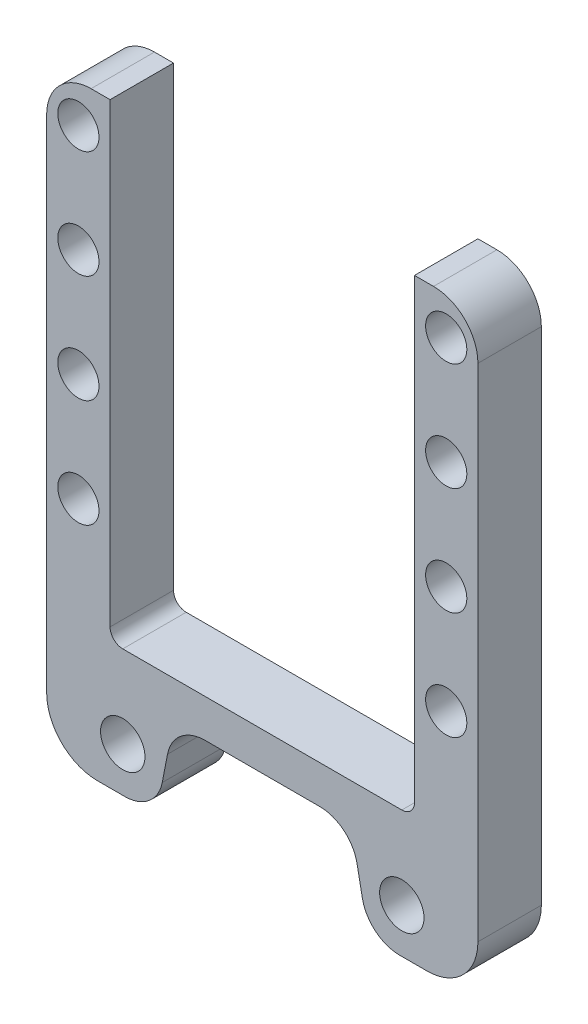
ISO-10303-21;
HEADER;
FILE_DESCRIPTION(('STEP AP214'),'2;1');
FILE_NAME('part.step','',(''),(''),'','','');
FILE_SCHEMA(('AUTOMOTIVE_DESIGN { 1 0 10303 214 1 1 1 1 }'));
ENDSEC;
DATA;
#1=APPLICATION_CONTEXT('core data for automotive mechanical design processes');
#2=APPLICATION_PROTOCOL_DEFINITION('international standard','automotive_design',2000,#1);
#3=PRODUCT_CONTEXT('',#1,'mechanical');
#4=PRODUCT('Part','Part','',(#3));
#5=PRODUCT_RELATED_PRODUCT_CATEGORY('part','',(#4));
#6=PRODUCT_DEFINITION_FORMATION('','',#4);
#7=PRODUCT_DEFINITION_CONTEXT('part definition',#1,'design');
#8=PRODUCT_DEFINITION('design','',#6,#7);
#9=PRODUCT_DEFINITION_SHAPE('','',#8);
#10=(LENGTH_UNIT() NAMED_UNIT(*) SI_UNIT(.MILLI.,.METRE.));
#11=(NAMED_UNIT(*) PLANE_ANGLE_UNIT() SI_UNIT($,.RADIAN.));
#12=(NAMED_UNIT(*) SI_UNIT($,.STERADIAN.) SOLID_ANGLE_UNIT());
#13=UNCERTAINTY_MEASURE_WITH_UNIT(LENGTH_MEASURE(1.E-05),#10,'distance_accuracy_value','');
#14=(GEOMETRIC_REPRESENTATION_CONTEXT(3) GLOBAL_UNCERTAINTY_ASSIGNED_CONTEXT((#13)) GLOBAL_UNIT_ASSIGNED_CONTEXT((#10,
#11,#12)) REPRESENTATION_CONTEXT('',''));
#15=CARTESIAN_POINT('',(0.,0.,0.));
#16=DIRECTION('',(0.,0.,1.));
#17=DIRECTION('',(1.,0.,0.));
#18=AXIS2_PLACEMENT_3D('',#15,#16,#17);
#19=CARTESIAN_POINT('',(0.,0.,10.));
#20=DIRECTION('',(0.,0.,1.));
#21=DIRECTION('',(1.,0.,0.));
#22=AXIS2_PLACEMENT_3D('',#19,#20,#21);
#23=PLANE('',#22);
#24=CARTESIAN_POINT('',(29.,53.,10.));
#25=DIRECTION('',(0.,0.,1.));
#26=DIRECTION('',(1.,0.,0.));
#27=AXIS2_PLACEMENT_3D('',#24,#25,#26);
#28=CIRCLE('',#27,3.25);
#29=CARTESIAN_POINT('',(32.25,53.,10.));
#30=VERTEX_POINT('',#29);
#31=EDGE_CURVE('E242',#30,#30,#28,.T.);
#32=ORIENTED_EDGE('',*,*,#31,.F.);
#33=EDGE_LOOP('',(#32));
#34=FACE_BOUND('',#33,.T.);
#35=CARTESIAN_POINT('',(29.,87.,10.));
#36=DIRECTION('',(0.,0.,1.));
#37=DIRECTION('',(1.,0.,0.));
#38=AXIS2_PLACEMENT_3D('',#35,#36,#37);
#39=CIRCLE('',#38,3.25);
#40=CARTESIAN_POINT('',(32.25,87.,10.));
#41=VERTEX_POINT('',#40);
#42=EDGE_CURVE('E254',#41,#41,#39,.T.);
#43=ORIENTED_EDGE('',*,*,#42,.F.);
#44=EDGE_LOOP('',(#43));
#45=FACE_BOUND('',#44,.T.);
#46=DIRECTION('',(0.,1.,0.));
#47=VECTOR('',#46,1.);
#48=CARTESIAN_POINT('',(34.,16.,10.));
#49=LINE('',#48,#47);
#50=CARTESIAN_POINT('',(34.,24.,10.));
#51=VERTEX_POINT('',#50);
#52=CARTESIAN_POINT('',(34.,103.,10.));
#53=VERTEX_POINT('',#52);
#54=EDGE_CURVE('E282',#51,#53,#49,.T.);
#55=ORIENTED_EDGE('',*,*,#54,.T.);
#56=CARTESIAN_POINT('',(27.,103.,10.));
#57=DIRECTION('',(0.,0.,1.));
#58=DIRECTION('',(1.,0.,0.));
#59=AXIS2_PLACEMENT_3D('',#56,#57,#58);
#60=CIRCLE('',#59,7.);
#61=CARTESIAN_POINT('',(27.,110.,10.));
#62=VERTEX_POINT('',#61);
#63=EDGE_CURVE('E369',#53,#62,#60,.T.);
#64=ORIENTED_EDGE('',*,*,#63,.T.);
#65=DIRECTION('',(-1.,0.,0.));
#66=VECTOR('',#65,1.);
#67=CARTESIAN_POINT('',(34.,110.,10.));
#68=LINE('',#67,#66);
#69=CARTESIAN_POINT('',(24.,110.,10.));
#70=VERTEX_POINT('',#69);
#71=EDGE_CURVE('E266',#62,#70,#68,.T.);
#72=ORIENTED_EDGE('',*,*,#71,.T.);
#73=DIRECTION('',(0.,-1.,0.));
#74=VECTOR('',#73,1.);
#75=CARTESIAN_POINT('',(24.,110.,10.));
#76=LINE('',#75,#74);
#77=CARTESIAN_POINT('',(24.,38.,10.));
#78=VERTEX_POINT('',#77);
#79=EDGE_CURVE('E268',#70,#78,#76,.T.);
#80=ORIENTED_EDGE('',*,*,#79,.T.);
#81=CARTESIAN_POINT('',(22.,38.,10.));
#82=DIRECTION('',(0.,0.,1.));
#83=DIRECTION('',(1.,0.,0.));
#84=AXIS2_PLACEMENT_3D('',#81,#82,#83);
#85=CIRCLE('',#84,2.);
#86=CARTESIAN_POINT('',(22.,36.,10.));
#87=VERTEX_POINT('',#86);
#88=EDGE_CURVE('E11',#78,#87,#85,.F.);
#89=ORIENTED_EDGE('',*,*,#88,.T.);
#90=DIRECTION('',(-1.,0.,0.));
#91=VECTOR('',#90,1.);
#92=CARTESIAN_POINT('',(24.,36.,10.));
#93=LINE('',#92,#91);
#94=CARTESIAN_POINT('',(-22.,36.,10.));
#95=VERTEX_POINT('',#94);
#96=EDGE_CURVE('E271',#87,#95,#93,.T.);
#97=ORIENTED_EDGE('',*,*,#96,.T.);
#98=CARTESIAN_POINT('',(-22.,38.,10.));
#99=DIRECTION('',(0.,0.,1.));
#100=DIRECTION('',(1.,0.,0.));
#101=AXIS2_PLACEMENT_3D('',#98,#99,#100);
#102=CIRCLE('',#101,2.);
#103=CARTESIAN_POINT('',(-24.,38.,10.));
#104=VERTEX_POINT('',#103);
#105=EDGE_CURVE('E212',#95,#104,#102,.F.);
#106=ORIENTED_EDGE('',*,*,#105,.T.);
#107=DIRECTION('',(0.,-1.,0.));
#108=VECTOR('',#107,1.);
#109=CARTESIAN_POINT('',(-24.,110.,10.));
#110=LINE('',#109,#108);
#111=CARTESIAN_POINT('',(-24.,110.,10.));
#112=VERTEX_POINT('',#111);
#113=EDGE_CURVE('E195',#112,#104,#110,.T.);
#114=ORIENTED_EDGE('',*,*,#113,.F.);
#115=DIRECTION('',(1.,0.,0.));
#116=VECTOR('',#115,1.);
#117=CARTESIAN_POINT('',(-34.,110.,10.));
#118=LINE('',#117,#116);
#119=CARTESIAN_POINT('',(-27.,110.,10.));
#120=VERTEX_POINT('',#119);
#121=EDGE_CURVE('E184',#120,#112,#118,.T.);
#122=ORIENTED_EDGE('',*,*,#121,.F.);
#123=CARTESIAN_POINT('',(-27.,103.,10.));
#124=DIRECTION('',(0.,0.,1.));
#125=DIRECTION('',(1.,0.,0.));
#126=AXIS2_PLACEMENT_3D('',#123,#124,#125);
#127=CIRCLE('',#126,7.);
#128=CARTESIAN_POINT('',(-34.,103.,10.));
#129=VERTEX_POINT('',#128);
#130=EDGE_CURVE('E367',#120,#129,#127,.T.);
#131=ORIENTED_EDGE('',*,*,#130,.T.);
#132=DIRECTION('',(0.,1.,0.));
#133=VECTOR('',#132,1.);
#134=CARTESIAN_POINT('',(-34.,16.,10.));
#135=LINE('',#134,#133);
#136=CARTESIAN_POINT('',(-34.,24.,10.));
#137=VERTEX_POINT('',#136);
#138=EDGE_CURVE('E206',#137,#129,#135,.T.);
#139=ORIENTED_EDGE('',*,*,#138,.F.);
#140=CARTESIAN_POINT('',(-26.,24.,10.));
#141=DIRECTION('',(0.,0.,1.));
#142=DIRECTION('',(1.,0.,0.));
#143=AXIS2_PLACEMENT_3D('',#140,#141,#142);
#144=CIRCLE('',#143,8.);
#145=CARTESIAN_POINT('',(-26.,16.,10.));
#146=VERTEX_POINT('',#145);
#147=EDGE_CURVE('E351',#137,#146,#144,.T.);
#148=ORIENTED_EDGE('',*,*,#147,.T.);
#149=DIRECTION('',(-1.,0.,0.));
#150=VECTOR('',#149,1.);
#151=CARTESIAN_POINT('',(-16.721324327928,16.,10.));
#152=LINE('',#151,#150);
#153=CARTESIAN_POINT('',(-21.667342642833,16.,10.));
#154=VERTEX_POINT('',#153);
#155=EDGE_CURVE('E216',#154,#146,#152,.T.);
#156=ORIENTED_EDGE('',*,*,#155,.F.);
#157=CARTESIAN_POINT('',(-21.667342642833,22.,10.));
#158=DIRECTION('',(0.,0.,1.));
#159=DIRECTION('',(1.,0.,0.));
#160=AXIS2_PLACEMENT_3D('',#157,#158,#159);
#161=CIRCLE('',#160,6.);
#162=CARTESIAN_POINT('',(-15.777579542147,20.8551460277407,10.));
#163=VERTEX_POINT('',#162);
#164=EDGE_CURVE('E316',#154,#163,#161,.T.);
#165=ORIENTED_EDGE('',*,*,#164,.T.);
#166=DIRECTION('',(-0.190808995376542,-0.981627183447665,0.));
#167=VECTOR('',#166,1.);
#168=CARTESIAN_POINT('',(-14.,30.,10.));
#169=LINE('',#168,#167);
#170=CARTESIAN_POINT('',(-14.943744785781,25.1448539722593,10.));
#171=VERTEX_POINT('',#170);
#172=EDGE_CURVE('E213',#171,#163,#169,.T.);
#173=ORIENTED_EDGE('',*,*,#172,.F.);
#174=CARTESIAN_POINT('',(-9.05398168509501,24.,10.));
#175=DIRECTION('',(0.,0.,1.));
#176=DIRECTION('',(1.,0.,0.));
#177=AXIS2_PLACEMENT_3D('',#174,#175,#176);
#178=CIRCLE('',#177,6.);
#179=CARTESIAN_POINT('',(-9.05398168509501,30.,10.));
#180=VERTEX_POINT('',#179);
#181=EDGE_CURVE('E334',#171,#180,#178,.F.);
#182=ORIENTED_EDGE('',*,*,#181,.T.);
#183=DIRECTION('',(1.,0.,0.));
#184=VECTOR('',#183,1.);
#185=CARTESIAN_POINT('',(0.,30.,10.));
#186=LINE('',#185,#184);
#187=CARTESIAN_POINT('',(9.05398168509501,30.,10.));
#188=VERTEX_POINT('',#187);
#189=EDGE_CURVE('E273',#180,#188,#186,.T.);
#190=ORIENTED_EDGE('',*,*,#189,.T.);
#191=CARTESIAN_POINT('',(9.05398168509501,24.,10.));
#192=DIRECTION('',(0.,0.,1.));
#193=DIRECTION('',(1.,0.,0.));
#194=AXIS2_PLACEMENT_3D('',#191,#192,#193);
#195=CIRCLE('',#194,6.);
#196=CARTESIAN_POINT('',(14.943744785781,25.1448539722593,10.));
#197=VERTEX_POINT('',#196);
#198=EDGE_CURVE('E338',#188,#197,#195,.F.);
#199=ORIENTED_EDGE('',*,*,#198,.T.);
#200=DIRECTION('',(0.190808995376542,-0.981627183447665,0.));
#201=VECTOR('',#200,1.);
#202=CARTESIAN_POINT('',(14.,30.,10.));
#203=LINE('',#202,#201);
#204=CARTESIAN_POINT('',(15.777579542147,20.8551460277407,10.));
#205=VERTEX_POINT('',#204);
#206=EDGE_CURVE('E276',#197,#205,#203,.T.);
#207=ORIENTED_EDGE('',*,*,#206,.T.);
#208=CARTESIAN_POINT('',(21.667342642833,22.,10.));
#209=DIRECTION('',(0.,0.,1.));
#210=DIRECTION('',(1.,0.,0.));
#211=AXIS2_PLACEMENT_3D('',#208,#209,#210);
#212=CIRCLE('',#211,6.);
#213=CARTESIAN_POINT('',(21.667342642833,16.,10.));
#214=VERTEX_POINT('',#213);
#215=EDGE_CURVE('E318',#205,#214,#212,.T.);
#216=ORIENTED_EDGE('',*,*,#215,.T.);
#217=DIRECTION('',(1.,0.,0.));
#218=VECTOR('',#217,1.);
#219=CARTESIAN_POINT('',(16.721324327928,16.,10.));
#220=LINE('',#219,#218);
#221=CARTESIAN_POINT('',(26.,16.,10.));
#222=VERTEX_POINT('',#221);
#223=EDGE_CURVE('E279',#214,#222,#220,.T.);
#224=ORIENTED_EDGE('',*,*,#223,.T.);
#225=CARTESIAN_POINT('',(26.,24.,10.));
#226=DIRECTION('',(0.,0.,1.));
#227=DIRECTION('',(1.,0.,0.));
#228=AXIS2_PLACEMENT_3D('',#225,#226,#227);
#229=CIRCLE('',#228,8.);
#230=EDGE_CURVE('E349',#222,#51,#229,.T.);
#231=ORIENTED_EDGE('',*,*,#230,.T.);
#232=EDGE_LOOP('',(#55,#64,#72,#80,#89,#97,#106,#114,#122,#131,#139,#148,#156,#165,#173,#182,
#190,#199,#207,#216,#224,#231));
#233=FACE_BOUND('',#232,.T.);
#234=CARTESIAN_POINT('',(22.,23.,10.));
#235=DIRECTION('',(0.,0.,1.));
#236=DIRECTION('',(1.,0.,0.));
#237=AXIS2_PLACEMENT_3D('',#234,#235,#236);
#238=CIRCLE('',#237,3.5);
#239=CARTESIAN_POINT('',(25.5,23.,10.));
#240=VERTEX_POINT('',#239);
#241=EDGE_CURVE('E260',#240,#240,#238,.T.);
#242=ORIENTED_EDGE('',*,*,#241,.F.);
#243=EDGE_LOOP('',(#242));
#244=FACE_BOUND('',#243,.T.);
#245=CARTESIAN_POINT('',(29.,104.,10.));
#246=DIRECTION('',(0.,0.,1.));
#247=DIRECTION('',(1.,0.,0.));
#248=AXIS2_PLACEMENT_3D('',#245,#246,#247);
#249=CIRCLE('',#248,3.25);
#250=CARTESIAN_POINT('',(32.25,104.,10.));
#251=VERTEX_POINT('',#250);
#252=EDGE_CURVE('E248',#251,#251,#249,.T.);
#253=ORIENTED_EDGE('',*,*,#252,.F.);
#254=EDGE_LOOP('',(#253));
#255=FACE_BOUND('',#254,.T.);
#256=CARTESIAN_POINT('',(29.,70.,10.));
#257=DIRECTION('',(0.,0.,1.));
#258=DIRECTION('',(1.,0.,0.));
#259=AXIS2_PLACEMENT_3D('',#256,#257,#258);
#260=CIRCLE('',#259,3.25);
#261=CARTESIAN_POINT('',(32.25,70.,10.));
#262=VERTEX_POINT('',#261);
#263=EDGE_CURVE('E236',#262,#262,#260,.T.);
#264=ORIENTED_EDGE('',*,*,#263,.F.);
#265=EDGE_LOOP('',(#264));
#266=FACE_BOUND('',#265,.T.);
#267=CARTESIAN_POINT('',(-29.,53.,10.));
#268=DIRECTION('',(0.,0.,-1.));
#269=DIRECTION('',(-1.,0.,0.));
#270=AXIS2_PLACEMENT_3D('',#267,#268,#269);
#271=CIRCLE('',#270,3.25);
#272=CARTESIAN_POINT('',(-32.25,53.,10.));
#273=VERTEX_POINT('',#272);
#274=EDGE_CURVE('E590',#273,#273,#271,.T.);
#275=ORIENTED_EDGE('',*,*,#274,.T.);
#276=EDGE_LOOP('',(#275));
#277=FACE_BOUND('',#276,.T.);
#278=CARTESIAN_POINT('',(-29.,87.,10.));
#279=DIRECTION('',(0.,0.,-1.));
#280=DIRECTION('',(-1.,0.,0.));
#281=AXIS2_PLACEMENT_3D('',#278,#279,#280);
#282=CIRCLE('',#281,3.25);
#283=CARTESIAN_POINT('',(-32.25,87.,10.));
#284=VERTEX_POINT('',#283);
#285=EDGE_CURVE('E598',#284,#284,#282,.T.);
#286=ORIENTED_EDGE('',*,*,#285,.T.);
#287=EDGE_LOOP('',(#286));
#288=FACE_BOUND('',#287,.T.);
#289=CARTESIAN_POINT('',(-22.,23.,10.));
#290=DIRECTION('',(0.,0.,-1.));
#291=DIRECTION('',(-1.,0.,0.));
#292=AXIS2_PLACEMENT_3D('',#289,#290,#291);
#293=CIRCLE('',#292,3.5);
#294=CARTESIAN_POINT('',(-25.5,23.,10.));
#295=VERTEX_POINT('',#294);
#296=EDGE_CURVE('E226',#295,#295,#293,.T.);
#297=ORIENTED_EDGE('',*,*,#296,.T.);
#298=EDGE_LOOP('',(#297));
#299=FACE_BOUND('',#298,.T.);
#300=CARTESIAN_POINT('',(-29.,104.,10.));
#301=DIRECTION('',(0.,0.,-1.));
#302=DIRECTION('',(-1.,0.,0.));
#303=AXIS2_PLACEMENT_3D('',#300,#301,#302);
#304=CIRCLE('',#303,3.25);
#305=CARTESIAN_POINT('',(-32.25,104.,10.));
#306=VERTEX_POINT('',#305);
#307=EDGE_CURVE('E594',#306,#306,#304,.T.);
#308=ORIENTED_EDGE('',*,*,#307,.T.);
#309=EDGE_LOOP('',(#308));
#310=FACE_BOUND('',#309,.T.);
#311=CARTESIAN_POINT('',(-29.,70.,10.));
#312=DIRECTION('',(0.,0.,-1.));
#313=DIRECTION('',(-1.,0.,0.));
#314=AXIS2_PLACEMENT_3D('',#311,#312,#313);
#315=CIRCLE('',#314,3.25);
#316=CARTESIAN_POINT('',(-32.25,70.,10.));
#317=VERTEX_POINT('',#316);
#318=EDGE_CURVE('E585',#317,#317,#315,.T.);
#319=ORIENTED_EDGE('',*,*,#318,.T.);
#320=EDGE_LOOP('',(#319));
#321=FACE_BOUND('',#320,.T.);
#322=ADVANCED_FACE('F35',(#34,#45,#233,#244,#255,#266,#277,#288,#299,#310,#321),#23,.T.);
#323=CARTESIAN_POINT('',(0.,0.,0.));
#324=DIRECTION('',(0.,0.,1.));
#325=DIRECTION('',(1.,0.,0.));
#326=AXIS2_PLACEMENT_3D('',#323,#324,#325);
#327=PLANE('',#326);
#328=DIRECTION('',(-1.,0.,0.));
#329=VECTOR('',#328,1.);
#330=CARTESIAN_POINT('',(34.,110.,0.));
#331=LINE('',#330,#329);
#332=CARTESIAN_POINT('',(27.,110.,0.));
#333=VERTEX_POINT('',#332);
#334=CARTESIAN_POINT('',(24.,110.,0.));
#335=VERTEX_POINT('',#334);
#336=EDGE_CURVE('E263',#333,#335,#331,.T.);
#337=ORIENTED_EDGE('',*,*,#336,.F.);
#338=CARTESIAN_POINT('',(27.,103.,0.));
#339=DIRECTION('',(0.,0.,1.));
#340=DIRECTION('',(1.,0.,0.));
#341=AXIS2_PLACEMENT_3D('',#338,#339,#340);
#342=CIRCLE('',#341,7.);
#343=CARTESIAN_POINT('',(34.,103.,0.));
#344=VERTEX_POINT('',#343);
#345=EDGE_CURVE('E363',#333,#344,#342,.F.);
#346=ORIENTED_EDGE('',*,*,#345,.T.);
#347=DIRECTION('',(0.,1.,0.));
#348=VECTOR('',#347,1.);
#349=CARTESIAN_POINT('',(34.,16.,0.));
#350=LINE('',#349,#348);
#351=CARTESIAN_POINT('',(34.,24.,0.));
#352=VERTEX_POINT('',#351);
#353=EDGE_CURVE('E269',#352,#344,#350,.T.);
#354=ORIENTED_EDGE('',*,*,#353,.F.);
#355=CARTESIAN_POINT('',(26.,24.,0.));
#356=DIRECTION('',(0.,0.,1.));
#357=DIRECTION('',(1.,0.,0.));
#358=AXIS2_PLACEMENT_3D('',#355,#356,#357);
#359=CIRCLE('',#358,8.);
#360=CARTESIAN_POINT('',(26.,16.,0.));
#361=VERTEX_POINT('',#360);
#362=EDGE_CURVE('E343',#352,#361,#359,.F.);
#363=ORIENTED_EDGE('',*,*,#362,.T.);
#364=DIRECTION('',(1.,0.,0.));
#365=VECTOR('',#364,1.);
#366=CARTESIAN_POINT('',(16.721324327928,16.,0.));
#367=LINE('',#366,#365);
#368=CARTESIAN_POINT('',(21.667342642833,16.,0.));
#369=VERTEX_POINT('',#368);
#370=EDGE_CURVE('E297',#369,#361,#367,.T.);
#371=ORIENTED_EDGE('',*,*,#370,.F.);
#372=CARTESIAN_POINT('',(21.667342642833,22.,0.));
#373=DIRECTION('',(0.,0.,1.));
#374=DIRECTION('',(1.,0.,0.));
#375=AXIS2_PLACEMENT_3D('',#372,#373,#374);
#376=CIRCLE('',#375,6.);
#377=CARTESIAN_POINT('',(15.777579542147,20.8551460277407,0.));
#378=VERTEX_POINT('',#377);
#379=EDGE_CURVE('E309',#369,#378,#376,.F.);
#380=ORIENTED_EDGE('',*,*,#379,.T.);
#381=DIRECTION('',(0.190808995376542,-0.981627183447665,0.));
#382=VECTOR('',#381,1.);
#383=CARTESIAN_POINT('',(14.,30.,0.));
#384=LINE('',#383,#382);
#385=CARTESIAN_POINT('',(14.943744785781,25.1448539722593,0.));
#386=VERTEX_POINT('',#385);
#387=EDGE_CURVE('E294',#386,#378,#384,.T.);
#388=ORIENTED_EDGE('',*,*,#387,.F.);
#389=CARTESIAN_POINT('',(9.05398168509501,24.,0.));
#390=DIRECTION('',(0.,0.,1.));
#391=DIRECTION('',(1.,0.,0.));
#392=AXIS2_PLACEMENT_3D('',#389,#390,#391);
#393=CIRCLE('',#392,6.);
#394=CARTESIAN_POINT('',(9.05398168509501,30.,0.));
#395=VERTEX_POINT('',#394);
#396=EDGE_CURVE('E336',#386,#395,#393,.T.);
#397=ORIENTED_EDGE('',*,*,#396,.T.);
#398=DIRECTION('',(1.,0.,0.));
#399=VECTOR('',#398,1.);
#400=CARTESIAN_POINT('',(0.,30.,0.));
#401=LINE('',#400,#399);
#402=CARTESIAN_POINT('',(-9.05398168509501,30.,0.));
#403=VERTEX_POINT('',#402);
#404=EDGE_CURVE('E291',#403,#395,#401,.T.);
#405=ORIENTED_EDGE('',*,*,#404,.F.);
#406=CARTESIAN_POINT('',(-9.05398168509501,24.,0.));
#407=DIRECTION('',(0.,0.,1.));
#408=DIRECTION('',(1.,0.,0.));
#409=AXIS2_PLACEMENT_3D('',#406,#407,#408);
#410=CIRCLE('',#409,6.);
#411=CARTESIAN_POINT('',(-14.943744785781,25.1448539722593,0.));
#412=VERTEX_POINT('',#411);
#413=EDGE_CURVE('E332',#403,#412,#410,.T.);
#414=ORIENTED_EDGE('',*,*,#413,.T.);
#415=DIRECTION('',(-0.190808995376542,-0.981627183447665,0.));
#416=VECTOR('',#415,1.);
#417=CARTESIAN_POINT('',(-14.,30.,0.));
#418=LINE('',#417,#416);
#419=CARTESIAN_POINT('',(-15.777579542147,20.8551460277407,0.));
#420=VERTEX_POINT('',#419);
#421=EDGE_CURVE('E228',#412,#420,#418,.T.);
#422=ORIENTED_EDGE('',*,*,#421,.T.);
#423=CARTESIAN_POINT('',(-21.667342642833,22.,0.));
#424=DIRECTION('',(0.,0.,1.));
#425=DIRECTION('',(1.,0.,0.));
#426=AXIS2_PLACEMENT_3D('',#423,#424,#425);
#427=CIRCLE('',#426,6.);
#428=CARTESIAN_POINT('',(-21.667342642833,16.,0.));
#429=VERTEX_POINT('',#428);
#430=EDGE_CURVE('E307',#420,#429,#427,.F.);
#431=ORIENTED_EDGE('',*,*,#430,.T.);
#432=DIRECTION('',(-1.,0.,0.));
#433=VECTOR('',#432,1.);
#434=CARTESIAN_POINT('',(-16.721324327928,16.,0.));
#435=LINE('',#434,#433);
#436=CARTESIAN_POINT('',(-26.,16.,0.));
#437=VERTEX_POINT('',#436);
#438=EDGE_CURVE('E231',#429,#437,#435,.T.);
#439=ORIENTED_EDGE('',*,*,#438,.T.);
#440=CARTESIAN_POINT('',(-26.,24.,0.));
#441=DIRECTION('',(0.,0.,1.));
#442=DIRECTION('',(1.,0.,0.));
#443=AXIS2_PLACEMENT_3D('',#440,#441,#442);
#444=CIRCLE('',#443,8.);
#445=CARTESIAN_POINT('',(-34.,24.,0.));
#446=VERTEX_POINT('',#445);
#447=EDGE_CURVE('E345',#437,#446,#444,.F.);
#448=ORIENTED_EDGE('',*,*,#447,.T.);
#449=DIRECTION('',(0.,1.,0.));
#450=VECTOR('',#449,1.);
#451=CARTESIAN_POINT('',(-34.,16.,0.));
#452=LINE('',#451,#450);
#453=CARTESIAN_POINT('',(-34.,103.,0.));
#454=VERTEX_POINT('',#453);
#455=EDGE_CURVE('E196',#446,#454,#452,.T.);
#456=ORIENTED_EDGE('',*,*,#455,.T.);
#457=CARTESIAN_POINT('',(-27.,103.,0.));
#458=DIRECTION('',(0.,0.,1.));
#459=DIRECTION('',(1.,0.,0.));
#460=AXIS2_PLACEMENT_3D('',#457,#458,#459);
#461=CIRCLE('',#460,7.);
#462=CARTESIAN_POINT('',(-27.,110.,0.));
#463=VERTEX_POINT('',#462);
#464=EDGE_CURVE('E361',#454,#463,#461,.F.);
#465=ORIENTED_EDGE('',*,*,#464,.T.);
#466=DIRECTION('',(1.,0.,0.));
#467=VECTOR('',#466,1.);
#468=CARTESIAN_POINT('',(-34.,110.,0.));
#469=LINE('',#468,#467);
#470=CARTESIAN_POINT('',(-24.,110.,0.));
#471=VERTEX_POINT('',#470);
#472=EDGE_CURVE('E224',#463,#471,#469,.T.);
#473=ORIENTED_EDGE('',*,*,#472,.T.);
#474=DIRECTION('',(0.,-1.,0.));
#475=VECTOR('',#474,1.);
#476=CARTESIAN_POINT('',(-24.,110.,0.));
#477=LINE('',#476,#475);
#478=CARTESIAN_POINT('',(-24.,38.,0.));
#479=VERTEX_POINT('',#478);
#480=EDGE_CURVE('E204',#471,#479,#477,.T.);
#481=ORIENTED_EDGE('',*,*,#480,.T.);
#482=CARTESIAN_POINT('',(-22.,38.,0.));
#483=DIRECTION('',(0.,0.,1.));
#484=DIRECTION('',(1.,0.,0.));
#485=AXIS2_PLACEMENT_3D('',#482,#483,#484);
#486=CIRCLE('',#485,2.);
#487=CARTESIAN_POINT('',(-22.,36.,0.));
#488=VERTEX_POINT('',#487);
#489=EDGE_CURVE('E383',#479,#488,#486,.T.);
#490=ORIENTED_EDGE('',*,*,#489,.T.);
#491=DIRECTION('',(-1.,0.,0.));
#492=VECTOR('',#491,1.);
#493=CARTESIAN_POINT('',(24.,36.,0.));
#494=LINE('',#493,#492);
#495=CARTESIAN_POINT('',(22.,36.,0.));
#496=VERTEX_POINT('',#495);
#497=EDGE_CURVE('E288',#496,#488,#494,.T.);
#498=ORIENTED_EDGE('',*,*,#497,.F.);
#499=CARTESIAN_POINT('',(22.,38.,0.));
#500=DIRECTION('',(0.,0.,1.));
#501=DIRECTION('',(1.,0.,0.));
#502=AXIS2_PLACEMENT_3D('',#499,#500,#501);
#503=CIRCLE('',#502,2.);
#504=CARTESIAN_POINT('',(24.,38.,0.));
#505=VERTEX_POINT('',#504);
#506=EDGE_CURVE('E43',#496,#505,#503,.T.);
#507=ORIENTED_EDGE('',*,*,#506,.T.);
#508=DIRECTION('',(0.,-1.,0.));
#509=VECTOR('',#508,1.);
#510=CARTESIAN_POINT('',(24.,110.,0.));
#511=LINE('',#510,#509);
#512=EDGE_CURVE('E286',#335,#505,#511,.T.);
#513=ORIENTED_EDGE('',*,*,#512,.F.);
#514=EDGE_LOOP('',(#337,#346,#354,#363,#371,#380,#388,#397,#405,#414,#422,#431,#439,#448,#456,
#465,#473,#481,#490,#498,#507,#513));
#515=FACE_BOUND('',#514,.T.);
#516=CARTESIAN_POINT('',(22.,23.,0.));
#517=DIRECTION('',(0.,0.,1.));
#518=DIRECTION('',(1.,0.,0.));
#519=AXIS2_PLACEMENT_3D('',#516,#517,#518);
#520=CIRCLE('',#519,3.5);
#521=CARTESIAN_POINT('',(25.5,23.,0.));
#522=VERTEX_POINT('',#521);
#523=EDGE_CURVE('E257',#522,#522,#520,.T.);
#524=ORIENTED_EDGE('',*,*,#523,.T.);
#525=EDGE_LOOP('',(#524));
#526=FACE_BOUND('',#525,.T.);
#527=CARTESIAN_POINT('',(29.,87.,0.));
#528=DIRECTION('',(0.,0.,1.));
#529=DIRECTION('',(1.,0.,0.));
#530=AXIS2_PLACEMENT_3D('',#527,#528,#529);
#531=CIRCLE('',#530,3.25);
#532=CARTESIAN_POINT('',(32.25,87.,0.));
#533=VERTEX_POINT('',#532);
#534=EDGE_CURVE('E251',#533,#533,#531,.T.);
#535=ORIENTED_EDGE('',*,*,#534,.T.);
#536=EDGE_LOOP('',(#535));
#537=FACE_BOUND('',#536,.T.);
#538=CARTESIAN_POINT('',(29.,104.,0.));
#539=DIRECTION('',(0.,0.,1.));
#540=DIRECTION('',(1.,0.,0.));
#541=AXIS2_PLACEMENT_3D('',#538,#539,#540);
#542=CIRCLE('',#541,3.25);
#543=CARTESIAN_POINT('',(32.25,104.,0.));
#544=VERTEX_POINT('',#543);
#545=EDGE_CURVE('E245',#544,#544,#542,.T.);
#546=ORIENTED_EDGE('',*,*,#545,.T.);
#547=EDGE_LOOP('',(#546));
#548=FACE_BOUND('',#547,.T.);
#549=CARTESIAN_POINT('',(29.,53.,0.));
#550=DIRECTION('',(0.,0.,1.));
#551=DIRECTION('',(1.,0.,0.));
#552=AXIS2_PLACEMENT_3D('',#549,#550,#551);
#553=CIRCLE('',#552,3.25);
#554=CARTESIAN_POINT('',(32.25,53.,0.));
#555=VERTEX_POINT('',#554);
#556=EDGE_CURVE('E239',#555,#555,#553,.T.);
#557=ORIENTED_EDGE('',*,*,#556,.T.);
#558=EDGE_LOOP('',(#557));
#559=FACE_BOUND('',#558,.T.);
#560=CARTESIAN_POINT('',(29.,70.,0.));
#561=DIRECTION('',(0.,0.,1.));
#562=DIRECTION('',(1.,0.,0.));
#563=AXIS2_PLACEMENT_3D('',#560,#561,#562);
#564=CIRCLE('',#563,3.25);
#565=CARTESIAN_POINT('',(32.25,70.,0.));
#566=VERTEX_POINT('',#565);
#567=EDGE_CURVE('E205',#566,#566,#564,.T.);
#568=ORIENTED_EDGE('',*,*,#567,.T.);
#569=EDGE_LOOP('',(#568));
#570=FACE_BOUND('',#569,.T.);
#571=CARTESIAN_POINT('',(-22.,23.,0.));
#572=DIRECTION('',(0.,0.,-1.));
#573=DIRECTION('',(-1.,0.,0.));
#574=AXIS2_PLACEMENT_3D('',#571,#572,#573);
#575=CIRCLE('',#574,3.5);
#576=CARTESIAN_POINT('',(-25.5,23.,0.));
#577=VERTEX_POINT('',#576);
#578=EDGE_CURVE('E568',#577,#577,#575,.T.);
#579=ORIENTED_EDGE('',*,*,#578,.F.);
#580=EDGE_LOOP('',(#579));
#581=FACE_BOUND('',#580,.T.);
#582=CARTESIAN_POINT('',(-29.,87.,0.));
#583=DIRECTION('',(0.,0.,-1.));
#584=DIRECTION('',(-1.,0.,0.));
#585=AXIS2_PLACEMENT_3D('',#582,#583,#584);
#586=CIRCLE('',#585,3.25);
#587=CARTESIAN_POINT('',(-32.25,87.,0.));
#588=VERTEX_POINT('',#587);
#589=EDGE_CURVE('E572',#588,#588,#586,.T.);
#590=ORIENTED_EDGE('',*,*,#589,.F.);
#591=EDGE_LOOP('',(#590));
#592=FACE_BOUND('',#591,.T.);
#593=CARTESIAN_POINT('',(-29.,104.,0.));
#594=DIRECTION('',(0.,0.,-1.));
#595=DIRECTION('',(-1.,0.,0.));
#596=AXIS2_PLACEMENT_3D('',#593,#594,#595);
#597=CIRCLE('',#596,3.25);
#598=CARTESIAN_POINT('',(-32.25,104.,0.));
#599=VERTEX_POINT('',#598);
#600=EDGE_CURVE('E576',#599,#599,#597,.T.);
#601=ORIENTED_EDGE('',*,*,#600,.F.);
#602=EDGE_LOOP('',(#601));
#603=FACE_BOUND('',#602,.T.);
#604=CARTESIAN_POINT('',(-29.,53.,0.));
#605=DIRECTION('',(0.,0.,-1.));
#606=DIRECTION('',(-1.,0.,0.));
#607=AXIS2_PLACEMENT_3D('',#604,#605,#606);
#608=CIRCLE('',#607,3.25);
#609=CARTESIAN_POINT('',(-32.25,53.,0.));
#610=VERTEX_POINT('',#609);
#611=EDGE_CURVE('E580',#610,#610,#608,.T.);
#612=ORIENTED_EDGE('',*,*,#611,.F.);
#613=EDGE_LOOP('',(#612));
#614=FACE_BOUND('',#613,.T.);
#615=CARTESIAN_POINT('',(-29.,70.,0.));
#616=DIRECTION('',(0.,0.,-1.));
#617=DIRECTION('',(-1.,0.,0.));
#618=AXIS2_PLACEMENT_3D('',#615,#616,#617);
#619=CIRCLE('',#618,3.25);
#620=CARTESIAN_POINT('',(-32.25,70.,0.));
#621=VERTEX_POINT('',#620);
#622=EDGE_CURVE('E583',#621,#621,#619,.T.);
#623=ORIENTED_EDGE('',*,*,#622,.F.);
#624=EDGE_LOOP('',(#623));
#625=FACE_BOUND('',#624,.T.);
#626=ADVANCED_FACE('F386',(#515,#526,#537,#548,#559,#570,#581,#592,#603,#614,#625),#327,.F.);
#627=CARTESIAN_POINT('',(34.,110.,10.));
#628=DIRECTION('',(0.,-1.,0.));
#629=DIRECTION('',(0.,0.,-1.));
#630=AXIS2_PLACEMENT_3D('',#627,#628,#629);
#631=PLANE('',#630);
#632=ORIENTED_EDGE('',*,*,#71,.F.);
#633=DIRECTION('',(0.,0.,-1.));
#634=VECTOR('',#633,1.);
#635=CARTESIAN_POINT('',(27.,110.,10.));
#636=LINE('',#635,#634);
#637=EDGE_CURVE('E358',#62,#333,#636,.T.);
#638=ORIENTED_EDGE('',*,*,#637,.T.);
#639=ORIENTED_EDGE('',*,*,#336,.T.);
#640=DIRECTION('',(0.,0.,-1.));
#641=VECTOR('',#640,1.);
#642=CARTESIAN_POINT('',(24.,110.,10.));
#643=LINE('',#642,#641);
#644=EDGE_CURVE('E284',#70,#335,#643,.T.);
#645=ORIENTED_EDGE('',*,*,#644,.F.);
#646=EDGE_LOOP('',(#632,#638,#639,#645));
#647=FACE_BOUND('',#646,.T.);
#648=ADVANCED_FACE('F411',(#647),#631,.F.);
#649=CARTESIAN_POINT('',(24.,110.,10.));
#650=DIRECTION('',(1.,0.,0.));
#651=DIRECTION('',(0.,1.,0.));
#652=AXIS2_PLACEMENT_3D('',#649,#650,#651);
#653=PLANE('',#652);
#654=ORIENTED_EDGE('',*,*,#512,.T.);
#655=DIRECTION('',(0.,0.,-1.));
#656=VECTOR('',#655,1.);
#657=CARTESIAN_POINT('',(24.,38.,10.));
#658=LINE('',#657,#656);
#659=EDGE_CURVE('E50',#505,#78,#658,.F.);
#660=ORIENTED_EDGE('',*,*,#659,.T.);
#661=ORIENTED_EDGE('',*,*,#79,.F.);
#662=ORIENTED_EDGE('',*,*,#644,.T.);
#663=EDGE_LOOP('',(#654,#660,#661,#662));
#664=FACE_BOUND('',#663,.T.);
#665=ADVANCED_FACE('F437',(#664),#653,.F.);
#666=CARTESIAN_POINT('',(24.,36.,10.));
#667=DIRECTION('',(0.,-1.,0.));
#668=DIRECTION('',(0.,0.,-1.));
#669=AXIS2_PLACEMENT_3D('',#666,#667,#668);
#670=PLANE('',#669);
#671=ORIENTED_EDGE('',*,*,#497,.T.);
#672=DIRECTION('',(0.,0.,-1.));
#673=VECTOR('',#672,1.);
#674=CARTESIAN_POINT('',(-22.,36.,10.));
#675=LINE('',#674,#673);
#676=EDGE_CURVE('E380',#488,#95,#675,.F.);
#677=ORIENTED_EDGE('',*,*,#676,.T.);
#678=ORIENTED_EDGE('',*,*,#96,.F.);
#679=DIRECTION('',(0.,0.,-1.));
#680=VECTOR('',#679,1.);
#681=CARTESIAN_POINT('',(22.,36.,0.));
#682=LINE('',#681,#680);
#683=EDGE_CURVE('E377',#87,#496,#682,.T.);
#684=ORIENTED_EDGE('',*,*,#683,.T.);
#685=EDGE_LOOP('',(#671,#677,#678,#684));
#686=FACE_BOUND('',#685,.T.);
#687=ADVANCED_FACE('F391',(#686),#670,.F.);
#688=CARTESIAN_POINT('',(0.,30.,10.));
#689=DIRECTION('',(0.,1.,0.));
#690=DIRECTION('',(0.,0.,1.));
#691=AXIS2_PLACEMENT_3D('',#688,#689,#690);
#692=PLANE('',#691);
#693=ORIENTED_EDGE('',*,*,#189,.F.);
#694=DIRECTION('',(0.,0.,-1.));
#695=VECTOR('',#694,1.);
#696=CARTESIAN_POINT('',(-9.05398168509501,30.,0.));
#697=LINE('',#696,#695);
#698=EDGE_CURVE('E329',#180,#403,#697,.T.);
#699=ORIENTED_EDGE('',*,*,#698,.T.);
#700=ORIENTED_EDGE('',*,*,#404,.T.);
#701=DIRECTION('',(0.,0.,-1.));
#702=VECTOR('',#701,1.);
#703=CARTESIAN_POINT('',(9.05398168509501,30.,10.));
#704=LINE('',#703,#702);
#705=EDGE_CURVE('E327',#395,#188,#704,.F.);
#706=ORIENTED_EDGE('',*,*,#705,.T.);
#707=EDGE_LOOP('',(#693,#699,#700,#706));
#708=FACE_BOUND('',#707,.T.);
#709=ADVANCED_FACE('F430',(#708),#692,.F.);
#710=CARTESIAN_POINT('',(14.,30.,10.));
#711=DIRECTION('',(0.981627183447665,0.190808995376542,0.));
#712=DIRECTION('',(-0.190808995376542,0.981627183447665,0.));
#713=AXIS2_PLACEMENT_3D('',#710,#711,#712);
#714=PLANE('',#713);
#715=ORIENTED_EDGE('',*,*,#387,.T.);
#716=DIRECTION('',(0.,0.,-1.));
#717=VECTOR('',#716,1.);
#718=CARTESIAN_POINT('',(15.777579542147,20.8551460277407,10.));
#719=LINE('',#718,#717);
#720=EDGE_CURVE('E314',#378,#205,#719,.F.);
#721=ORIENTED_EDGE('',*,*,#720,.T.);
#722=ORIENTED_EDGE('',*,*,#206,.F.);
#723=DIRECTION('',(0.,0.,-1.));
#724=VECTOR('',#723,1.);
#725=CARTESIAN_POINT('',(14.943744785781,25.1448539722593,0.));
#726=LINE('',#725,#724);
#727=EDGE_CURVE('E311',#197,#386,#726,.T.);
#728=ORIENTED_EDGE('',*,*,#727,.T.);
#729=EDGE_LOOP('',(#715,#721,#722,#728));
#730=FACE_BOUND('',#729,.T.);
#731=ADVANCED_FACE('F426',(#730),#714,.F.);
#732=CARTESIAN_POINT('',(16.721324327928,16.,10.));
#733=DIRECTION('',(0.,1.,0.));
#734=DIRECTION('',(0.,0.,1.));
#735=AXIS2_PLACEMENT_3D('',#732,#733,#734);
#736=PLANE('',#735);
#737=ORIENTED_EDGE('',*,*,#370,.T.);
#738=DIRECTION('',(0.,0.,-1.));
#739=VECTOR('',#738,1.);
#740=CARTESIAN_POINT('',(26.,16.,10.));
#741=LINE('',#740,#739);
#742=EDGE_CURVE('E356',#361,#222,#741,.F.);
#743=ORIENTED_EDGE('',*,*,#742,.T.);
#744=ORIENTED_EDGE('',*,*,#223,.F.);
#745=DIRECTION('',(0.,0.,-1.));
#746=VECTOR('',#745,1.);
#747=CARTESIAN_POINT('',(21.667342642833,16.,10.));
#748=LINE('',#747,#746);
#749=EDGE_CURVE('E304',#214,#369,#748,.T.);
#750=ORIENTED_EDGE('',*,*,#749,.T.);
#751=EDGE_LOOP('',(#737,#743,#744,#750));
#752=FACE_BOUND('',#751,.T.);
#753=ADVANCED_FACE('F422',(#752),#736,.F.);
#754=CARTESIAN_POINT('',(34.,16.,10.));
#755=DIRECTION('',(-1.,0.,0.));
#756=DIRECTION('',(0.,0.,1.));
#757=AXIS2_PLACEMENT_3D('',#754,#755,#756);
#758=PLANE('',#757);
#759=ORIENTED_EDGE('',*,*,#353,.T.);
#760=DIRECTION('',(0.,0.,-1.));
#761=VECTOR('',#760,1.);
#762=CARTESIAN_POINT('',(34.,103.,10.));
#763=LINE('',#762,#761);
#764=EDGE_CURVE('E365',#344,#53,#763,.F.);
#765=ORIENTED_EDGE('',*,*,#764,.T.);
#766=ORIENTED_EDGE('',*,*,#54,.F.);
#767=DIRECTION('',(0.,0.,-1.));
#768=VECTOR('',#767,1.);
#769=CARTESIAN_POINT('',(34.,24.,10.));
#770=LINE('',#769,#768);
#771=EDGE_CURVE('E353',#51,#352,#770,.T.);
#772=ORIENTED_EDGE('',*,*,#771,.T.);
#773=EDGE_LOOP('',(#759,#765,#766,#772));
#774=FACE_BOUND('',#773,.T.);
#775=ADVANCED_FACE('F419',(#774),#758,.F.);
#776=CARTESIAN_POINT('',(22.,23.,10.));
#777=DIRECTION('',(0.,0.,-1.));
#778=DIRECTION('',(-1.,0.,0.));
#779=AXIS2_PLACEMENT_3D('',#776,#777,#778);
#780=CYLINDRICAL_SURFACE('',#779,3.5);
#781=ORIENTED_EDGE('',*,*,#241,.T.);
#782=EDGE_LOOP('',(#781));
#783=FACE_BOUND('',#782,.T.);
#784=ORIENTED_EDGE('',*,*,#523,.F.);
#785=EDGE_LOOP('',(#784));
#786=FACE_BOUND('',#785,.T.);
#787=ADVANCED_FACE('F416',(#783,#786),#780,.F.);
#788=CARTESIAN_POINT('',(29.,87.,10.));
#789=DIRECTION('',(0.,0.,-1.));
#790=DIRECTION('',(-1.,0.,0.));
#791=AXIS2_PLACEMENT_3D('',#788,#789,#790);
#792=CYLINDRICAL_SURFACE('',#791,3.25);
#793=ORIENTED_EDGE('',*,*,#42,.T.);
#794=EDGE_LOOP('',(#793));
#795=FACE_BOUND('',#794,.T.);
#796=ORIENTED_EDGE('',*,*,#534,.F.);
#797=EDGE_LOOP('',(#796));
#798=FACE_BOUND('',#797,.T.);
#799=ADVANCED_FACE('F546',(#795,#798),#792,.F.);
#800=CARTESIAN_POINT('',(29.,104.,10.));
#801=DIRECTION('',(0.,0.,-1.));
#802=DIRECTION('',(-1.,0.,0.));
#803=AXIS2_PLACEMENT_3D('',#800,#801,#802);
#804=CYLINDRICAL_SURFACE('',#803,3.25);
#805=ORIENTED_EDGE('',*,*,#252,.T.);
#806=EDGE_LOOP('',(#805));
#807=FACE_BOUND('',#806,.T.);
#808=ORIENTED_EDGE('',*,*,#545,.F.);
#809=EDGE_LOOP('',(#808));
#810=FACE_BOUND('',#809,.T.);
#811=ADVANCED_FACE('F543',(#807,#810),#804,.F.);
#812=CARTESIAN_POINT('',(29.,53.,10.));
#813=DIRECTION('',(0.,0.,-1.));
#814=DIRECTION('',(-1.,0.,0.));
#815=AXIS2_PLACEMENT_3D('',#812,#813,#814);
#816=CYLINDRICAL_SURFACE('',#815,3.25);
#817=ORIENTED_EDGE('',*,*,#31,.T.);
#818=EDGE_LOOP('',(#817));
#819=FACE_BOUND('',#818,.T.);
#820=ORIENTED_EDGE('',*,*,#556,.F.);
#821=EDGE_LOOP('',(#820));
#822=FACE_BOUND('',#821,.T.);
#823=ADVANCED_FACE('F539',(#819,#822),#816,.F.);
#824=CARTESIAN_POINT('',(29.,70.,10.));
#825=DIRECTION('',(0.,0.,-1.));
#826=DIRECTION('',(-1.,0.,0.));
#827=AXIS2_PLACEMENT_3D('',#824,#825,#826);
#828=CYLINDRICAL_SURFACE('',#827,3.25);
#829=ORIENTED_EDGE('',*,*,#263,.T.);
#830=EDGE_LOOP('',(#829));
#831=FACE_BOUND('',#830,.T.);
#832=ORIENTED_EDGE('',*,*,#567,.F.);
#833=EDGE_LOOP('',(#832));
#834=FACE_BOUND('',#833,.T.);
#835=ADVANCED_FACE('F536',(#831,#834),#828,.F.);
#836=CARTESIAN_POINT('',(-34.,110.,10.));
#837=DIRECTION('',(0.,-1.,0.));
#838=DIRECTION('',(0.,0.,-1.));
#839=AXIS2_PLACEMENT_3D('',#836,#837,#838);
#840=PLANE('',#839);
#841=ORIENTED_EDGE('',*,*,#472,.F.);
#842=DIRECTION('',(0.,0.,-1.));
#843=VECTOR('',#842,1.);
#844=CARTESIAN_POINT('',(-27.,110.,10.));
#845=LINE('',#844,#843);
#846=EDGE_CURVE('E191',#463,#120,#845,.F.);
#847=ORIENTED_EDGE('',*,*,#846,.T.);
#848=ORIENTED_EDGE('',*,*,#121,.T.);
#849=DIRECTION('',(0.,0.,-1.));
#850=VECTOR('',#849,1.);
#851=CARTESIAN_POINT('',(-24.,110.,10.));
#852=LINE('',#851,#850);
#853=EDGE_CURVE('E188',#112,#471,#852,.T.);
#854=ORIENTED_EDGE('',*,*,#853,.T.);
#855=EDGE_LOOP('',(#841,#847,#848,#854));
#856=FACE_BOUND('',#855,.T.);
#857=ADVANCED_FACE('F187',(#856),#840,.F.);
#858=CARTESIAN_POINT('',(-24.,110.,10.));
#859=DIRECTION('',(-1.,0.,0.));
#860=DIRECTION('',(0.,1.,0.));
#861=AXIS2_PLACEMENT_3D('',#858,#859,#860);
#862=PLANE('',#861);
#863=ORIENTED_EDGE('',*,*,#113,.T.);
#864=DIRECTION('',(0.,0.,-1.));
#865=VECTOR('',#864,1.);
#866=CARTESIAN_POINT('',(-24.,38.,0.));
#867=LINE('',#866,#865);
#868=EDGE_CURVE('E375',#104,#479,#867,.T.);
#869=ORIENTED_EDGE('',*,*,#868,.T.);
#870=ORIENTED_EDGE('',*,*,#480,.F.);
#871=ORIENTED_EDGE('',*,*,#853,.F.);
#872=EDGE_LOOP('',(#863,#869,#870,#871));
#873=FACE_BOUND('',#872,.T.);
#874=ADVANCED_FACE('F200',(#873),#862,.F.);
#875=CARTESIAN_POINT('',(-14.,30.,10.));
#876=DIRECTION('',(-0.981627183447665,0.190808995376542,0.));
#877=DIRECTION('',(0.190808995376542,0.981627183447665,0.));
#878=AXIS2_PLACEMENT_3D('',#875,#876,#877);
#879=PLANE('',#878);
#880=ORIENTED_EDGE('',*,*,#172,.T.);
#881=DIRECTION('',(0.,0.,-1.));
#882=VECTOR('',#881,1.);
#883=CARTESIAN_POINT('',(-15.777579542147,20.8551460277407,10.));
#884=LINE('',#883,#882);
#885=EDGE_CURVE('E322',#163,#420,#884,.T.);
#886=ORIENTED_EDGE('',*,*,#885,.T.);
#887=ORIENTED_EDGE('',*,*,#421,.F.);
#888=DIRECTION('',(0.,0.,-1.));
#889=VECTOR('',#888,1.);
#890=CARTESIAN_POINT('',(-14.943744785781,25.1448539722593,10.));
#891=LINE('',#890,#889);
#892=EDGE_CURVE('E320',#412,#171,#891,.F.);
#893=ORIENTED_EDGE('',*,*,#892,.T.);
#894=EDGE_LOOP('',(#880,#886,#887,#893));
#895=FACE_BOUND('',#894,.T.);
#896=ADVANCED_FACE('F500',(#895),#879,.F.);
#897=CARTESIAN_POINT('',(-16.721324327928,16.,10.));
#898=DIRECTION('',(0.,1.,0.));
#899=DIRECTION('',(0.,0.,1.));
#900=AXIS2_PLACEMENT_3D('',#897,#898,#899);
#901=PLANE('',#900);
#902=ORIENTED_EDGE('',*,*,#155,.T.);
#903=DIRECTION('',(0.,0.,-1.));
#904=VECTOR('',#903,1.);
#905=CARTESIAN_POINT('',(-26.,16.,10.));
#906=LINE('',#905,#904);
#907=EDGE_CURVE('E340',#146,#437,#906,.T.);
#908=ORIENTED_EDGE('',*,*,#907,.T.);
#909=ORIENTED_EDGE('',*,*,#438,.F.);
#910=DIRECTION('',(0.,0.,-1.));
#911=VECTOR('',#910,1.);
#912=CARTESIAN_POINT('',(-21.667342642833,16.,10.));
#913=LINE('',#912,#911);
#914=EDGE_CURVE('E325',#429,#154,#913,.F.);
#915=ORIENTED_EDGE('',*,*,#914,.T.);
#916=EDGE_LOOP('',(#902,#908,#909,#915));
#917=FACE_BOUND('',#916,.T.);
#918=ADVANCED_FACE('F507',(#917),#901,.F.);
#919=CARTESIAN_POINT('',(-34.,16.,10.));
#920=DIRECTION('',(1.,0.,0.));
#921=DIRECTION('',(0.,0.,1.));
#922=AXIS2_PLACEMENT_3D('',#919,#920,#921);
#923=PLANE('',#922);
#924=ORIENTED_EDGE('',*,*,#138,.T.);
#925=DIRECTION('',(0.,0.,-1.));
#926=VECTOR('',#925,1.);
#927=CARTESIAN_POINT('',(-34.,103.,10.));
#928=LINE('',#927,#926);
#929=EDGE_CURVE('E371',#129,#454,#928,.T.);
#930=ORIENTED_EDGE('',*,*,#929,.T.);
#931=ORIENTED_EDGE('',*,*,#455,.F.);
#932=DIRECTION('',(0.,0.,-1.));
#933=VECTOR('',#932,1.);
#934=CARTESIAN_POINT('',(-34.,24.,10.));
#935=LINE('',#934,#933);
#936=EDGE_CURVE('E347',#446,#137,#935,.F.);
#937=ORIENTED_EDGE('',*,*,#936,.T.);
#938=EDGE_LOOP('',(#924,#930,#931,#937));
#939=FACE_BOUND('',#938,.T.);
#940=ADVANCED_FACE('F514',(#939),#923,.F.);
#941=CARTESIAN_POINT('',(-22.,23.,10.));
#942=DIRECTION('',(0.,0.,-1.));
#943=DIRECTION('',(1.,0.,0.));
#944=AXIS2_PLACEMENT_3D('',#941,#942,#943);
#945=CYLINDRICAL_SURFACE('',#944,3.5);
#946=ORIENTED_EDGE('',*,*,#296,.F.);
#947=EDGE_LOOP('',(#946));
#948=FACE_BOUND('',#947,.T.);
#949=ORIENTED_EDGE('',*,*,#578,.T.);
#950=EDGE_LOOP('',(#949));
#951=FACE_BOUND('',#950,.T.);
#952=ADVANCED_FACE('F518',(#948,#951),#945,.F.);
#953=CARTESIAN_POINT('',(-29.,87.,10.));
#954=DIRECTION('',(0.,0.,-1.));
#955=DIRECTION('',(1.,0.,0.));
#956=AXIS2_PLACEMENT_3D('',#953,#954,#955);
#957=CYLINDRICAL_SURFACE('',#956,3.25);
#958=ORIENTED_EDGE('',*,*,#285,.F.);
#959=EDGE_LOOP('',(#958));
#960=FACE_BOUND('',#959,.T.);
#961=ORIENTED_EDGE('',*,*,#589,.T.);
#962=EDGE_LOOP('',(#961));
#963=FACE_BOUND('',#962,.T.);
#964=ADVANCED_FACE('F524',(#960,#963),#957,.F.);
#965=CARTESIAN_POINT('',(-29.,104.,10.));
#966=DIRECTION('',(0.,0.,-1.));
#967=DIRECTION('',(1.,0.,0.));
#968=AXIS2_PLACEMENT_3D('',#965,#966,#967);
#969=CYLINDRICAL_SURFACE('',#968,3.25);
#970=ORIENTED_EDGE('',*,*,#307,.F.);
#971=EDGE_LOOP('',(#970));
#972=FACE_BOUND('',#971,.T.);
#973=ORIENTED_EDGE('',*,*,#600,.T.);
#974=EDGE_LOOP('',(#973));
#975=FACE_BOUND('',#974,.T.);
#976=ADVANCED_FACE('F617',(#972,#975),#969,.F.);
#977=CARTESIAN_POINT('',(-29.,53.,10.));
#978=DIRECTION('',(0.,0.,-1.));
#979=DIRECTION('',(1.,0.,0.));
#980=AXIS2_PLACEMENT_3D('',#977,#978,#979);
#981=CYLINDRICAL_SURFACE('',#980,3.25);
#982=ORIENTED_EDGE('',*,*,#274,.F.);
#983=EDGE_LOOP('',(#982));
#984=FACE_BOUND('',#983,.T.);
#985=ORIENTED_EDGE('',*,*,#611,.T.);
#986=EDGE_LOOP('',(#985));
#987=FACE_BOUND('',#986,.T.);
#988=ADVANCED_FACE('F612',(#984,#987),#981,.F.);
#989=CARTESIAN_POINT('',(-29.,70.,10.));
#990=DIRECTION('',(0.,0.,-1.));
#991=DIRECTION('',(1.,0.,0.));
#992=AXIS2_PLACEMENT_3D('',#989,#990,#991);
#993=CYLINDRICAL_SURFACE('',#992,3.25);
#994=ORIENTED_EDGE('',*,*,#318,.F.);
#995=EDGE_LOOP('',(#994));
#996=FACE_BOUND('',#995,.T.);
#997=ORIENTED_EDGE('',*,*,#622,.T.);
#998=EDGE_LOOP('',(#997));
#999=FACE_BOUND('',#998,.T.);
#1000=ADVANCED_FACE('F447',(#996,#999),#993,.F.);
#1001=CARTESIAN_POINT('',(21.667342642833,22.,10.));
#1002=DIRECTION('',(0.,0.,-1.));
#1003=DIRECTION('',(-1.,0.,0.));
#1004=AXIS2_PLACEMENT_3D('',#1001,#1002,#1003);
#1005=CYLINDRICAL_SURFACE('',#1004,6.);
#1006=ORIENTED_EDGE('',*,*,#215,.F.);
#1007=ORIENTED_EDGE('',*,*,#720,.F.);
#1008=ORIENTED_EDGE('',*,*,#379,.F.);
#1009=ORIENTED_EDGE('',*,*,#749,.F.);
#1010=EDGE_LOOP('',(#1006,#1007,#1008,#1009));
#1011=FACE_BOUND('',#1010,.T.);
#1012=ADVANCED_FACE('F443',(#1011),#1005,.T.);
#1013=CARTESIAN_POINT('',(-21.667342642833,22.,10.));
#1014=DIRECTION('',(0.,0.,-1.));
#1015=DIRECTION('',(-1.,0.,0.));
#1016=AXIS2_PLACEMENT_3D('',#1013,#1014,#1015);
#1017=CYLINDRICAL_SURFACE('',#1016,6.);
#1018=ORIENTED_EDGE('',*,*,#164,.F.);
#1019=ORIENTED_EDGE('',*,*,#914,.F.);
#1020=ORIENTED_EDGE('',*,*,#430,.F.);
#1021=ORIENTED_EDGE('',*,*,#885,.F.);
#1022=EDGE_LOOP('',(#1018,#1019,#1020,#1021));
#1023=FACE_BOUND('',#1022,.T.);
#1024=ADVANCED_FACE('F446',(#1023),#1017,.T.);
#1025=CARTESIAN_POINT('',(-9.05398168509501,24.,10.));
#1026=DIRECTION('',(0.,0.,1.));
#1027=DIRECTION('',(1.,0.,0.));
#1028=AXIS2_PLACEMENT_3D('',#1025,#1026,#1027);
#1029=CYLINDRICAL_SURFACE('',#1028,6.);
#1030=ORIENTED_EDGE('',*,*,#181,.F.);
#1031=ORIENTED_EDGE('',*,*,#892,.F.);
#1032=ORIENTED_EDGE('',*,*,#413,.F.);
#1033=ORIENTED_EDGE('',*,*,#698,.F.);
#1034=EDGE_LOOP('',(#1030,#1031,#1032,#1033));
#1035=FACE_BOUND('',#1034,.T.);
#1036=ADVANCED_FACE('F451',(#1035),#1029,.F.);
#1037=CARTESIAN_POINT('',(9.05398168509501,24.,10.));
#1038=DIRECTION('',(0.,0.,1.));
#1039=DIRECTION('',(1.,0.,0.));
#1040=AXIS2_PLACEMENT_3D('',#1037,#1038,#1039);
#1041=CYLINDRICAL_SURFACE('',#1040,6.);
#1042=ORIENTED_EDGE('',*,*,#198,.F.);
#1043=ORIENTED_EDGE('',*,*,#705,.F.);
#1044=ORIENTED_EDGE('',*,*,#396,.F.);
#1045=ORIENTED_EDGE('',*,*,#727,.F.);
#1046=EDGE_LOOP('',(#1042,#1043,#1044,#1045));
#1047=FACE_BOUND('',#1046,.T.);
#1048=ADVANCED_FACE('F455',(#1047),#1041,.F.);
#1049=CARTESIAN_POINT('',(-26.,24.,10.));
#1050=DIRECTION('',(0.,0.,-1.));
#1051=DIRECTION('',(-1.,0.,0.));
#1052=AXIS2_PLACEMENT_3D('',#1049,#1050,#1051);
#1053=CYLINDRICAL_SURFACE('',#1052,8.);
#1054=ORIENTED_EDGE('',*,*,#147,.F.);
#1055=ORIENTED_EDGE('',*,*,#936,.F.);
#1056=ORIENTED_EDGE('',*,*,#447,.F.);
#1057=ORIENTED_EDGE('',*,*,#907,.F.);
#1058=EDGE_LOOP('',(#1054,#1055,#1056,#1057));
#1059=FACE_BOUND('',#1058,.T.);
#1060=ADVANCED_FACE('F459',(#1059),#1053,.T.);
#1061=CARTESIAN_POINT('',(26.,24.,10.));
#1062=DIRECTION('',(0.,0.,-1.));
#1063=DIRECTION('',(-1.,0.,0.));
#1064=AXIS2_PLACEMENT_3D('',#1061,#1062,#1063);
#1065=CYLINDRICAL_SURFACE('',#1064,8.);
#1066=ORIENTED_EDGE('',*,*,#230,.F.);
#1067=ORIENTED_EDGE('',*,*,#742,.F.);
#1068=ORIENTED_EDGE('',*,*,#362,.F.);
#1069=ORIENTED_EDGE('',*,*,#771,.F.);
#1070=EDGE_LOOP('',(#1066,#1067,#1068,#1069));
#1071=FACE_BOUND('',#1070,.T.);
#1072=ADVANCED_FACE('F463',(#1071),#1065,.T.);
#1073=CARTESIAN_POINT('',(27.,103.,10.));
#1074=DIRECTION('',(0.,0.,-1.));
#1075=DIRECTION('',(-1.,0.,0.));
#1076=AXIS2_PLACEMENT_3D('',#1073,#1074,#1075);
#1077=CYLINDRICAL_SURFACE('',#1076,7.);
#1078=ORIENTED_EDGE('',*,*,#63,.F.);
#1079=ORIENTED_EDGE('',*,*,#764,.F.);
#1080=ORIENTED_EDGE('',*,*,#345,.F.);
#1081=ORIENTED_EDGE('',*,*,#637,.F.);
#1082=EDGE_LOOP('',(#1078,#1079,#1080,#1081));
#1083=FACE_BOUND('',#1082,.T.);
#1084=ADVANCED_FACE('F402',(#1083),#1077,.T.);
#1085=CARTESIAN_POINT('',(-27.,103.,10.));
#1086=DIRECTION('',(0.,0.,-1.));
#1087=DIRECTION('',(-1.,0.,0.));
#1088=AXIS2_PLACEMENT_3D('',#1085,#1086,#1087);
#1089=CYLINDRICAL_SURFACE('',#1088,7.);
#1090=ORIENTED_EDGE('',*,*,#130,.F.);
#1091=ORIENTED_EDGE('',*,*,#846,.F.);
#1092=ORIENTED_EDGE('',*,*,#464,.F.);
#1093=ORIENTED_EDGE('',*,*,#929,.F.);
#1094=EDGE_LOOP('',(#1090,#1091,#1092,#1093));
#1095=FACE_BOUND('',#1094,.T.);
#1096=ADVANCED_FACE('F396',(#1095),#1089,.T.);
#1097=CARTESIAN_POINT('',(-22.,38.,10.));
#1098=DIRECTION('',(0.,0.,1.));
#1099=DIRECTION('',(1.,0.,0.));
#1100=AXIS2_PLACEMENT_3D('',#1097,#1098,#1099);
#1101=CYLINDRICAL_SURFACE('',#1100,2.);
#1102=ORIENTED_EDGE('',*,*,#105,.F.);
#1103=ORIENTED_EDGE('',*,*,#676,.F.);
#1104=ORIENTED_EDGE('',*,*,#489,.F.);
#1105=ORIENTED_EDGE('',*,*,#868,.F.);
#1106=EDGE_LOOP('',(#1102,#1103,#1104,#1105));
#1107=FACE_BOUND('',#1106,.T.);
#1108=ADVANCED_FACE('F394',(#1107),#1101,.F.);
#1109=CARTESIAN_POINT('',(22.,38.,10.));
#1110=DIRECTION('',(0.,0.,1.));
#1111=DIRECTION('',(1.,0.,0.));
#1112=AXIS2_PLACEMENT_3D('',#1109,#1110,#1111);
#1113=CYLINDRICAL_SURFACE('',#1112,2.);
#1114=ORIENTED_EDGE('',*,*,#88,.F.);
#1115=ORIENTED_EDGE('',*,*,#659,.F.);
#1116=ORIENTED_EDGE('',*,*,#506,.F.);
#1117=ORIENTED_EDGE('',*,*,#683,.F.);
#1118=EDGE_LOOP('',(#1114,#1115,#1116,#1117));
#1119=FACE_BOUND('',#1118,.T.);
#1120=ADVANCED_FACE('F37',(#1119),#1113,.F.);
#1121=CLOSED_SHELL('',(#322,#626,#648,#665,#687,#709,#731,#753,#775,#787,#799,#811,#823,#835,
#857,#874,#896,#918,#940,#952,#964,#976,#988,#1000,#1012,#1024,#1036,#1048,#1060,#1072,#1084,
#1096,#1108,#1120));
#1122=MANIFOLD_SOLID_BREP('B2',#1121);
#1123=ADVANCED_BREP_SHAPE_REPRESENTATION('',(#18,#1122),#14);
#1124=SHAPE_DEFINITION_REPRESENTATION(#9,#1123);
ENDSEC;
END-ISO-10303-21;
